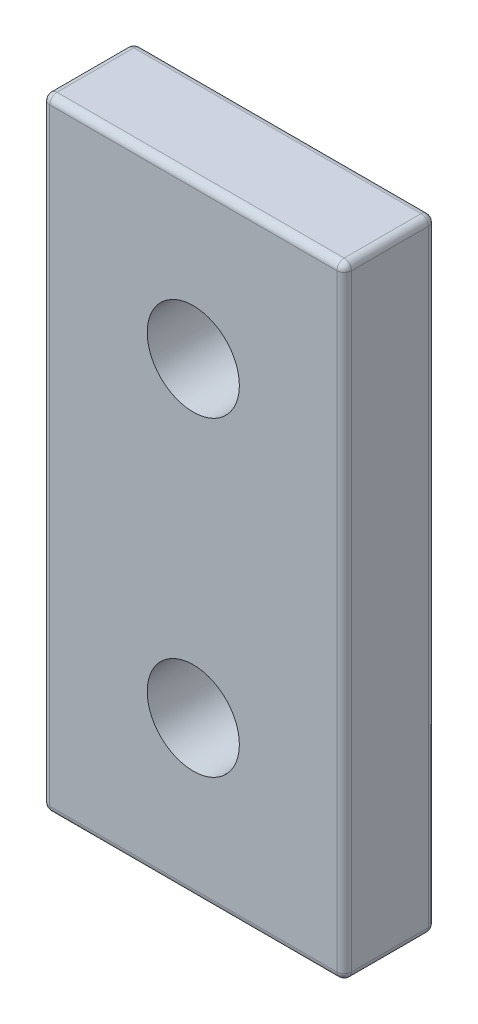
ISO-10303-21;
HEADER;
FILE_DESCRIPTION(('STEP AP214'),'2;1');
FILE_NAME('part.step','',(''),(''),'','','');
FILE_SCHEMA(('AUTOMOTIVE_DESIGN { 1 0 10303 214 1 1 1 1 }'));
ENDSEC;
DATA;
#1=APPLICATION_CONTEXT('core data for automotive mechanical design processes');
#2=APPLICATION_PROTOCOL_DEFINITION('international standard','automotive_design',2000,#1);
#3=PRODUCT_CONTEXT('',#1,'mechanical');
#4=PRODUCT('Part','Part','',(#3));
#5=PRODUCT_RELATED_PRODUCT_CATEGORY('part','',(#4));
#6=PRODUCT_DEFINITION_FORMATION('','',#4);
#7=PRODUCT_DEFINITION_CONTEXT('part definition',#1,'design');
#8=PRODUCT_DEFINITION('design','',#6,#7);
#9=PRODUCT_DEFINITION_SHAPE('','',#8);
#10=(LENGTH_UNIT() NAMED_UNIT(*) SI_UNIT(.MILLI.,.METRE.));
#11=(NAMED_UNIT(*) PLANE_ANGLE_UNIT() SI_UNIT($,.RADIAN.));
#12=(NAMED_UNIT(*) SI_UNIT($,.STERADIAN.) SOLID_ANGLE_UNIT());
#13=UNCERTAINTY_MEASURE_WITH_UNIT(LENGTH_MEASURE(1.E-05),#10,'distance_accuracy_value','');
#14=(GEOMETRIC_REPRESENTATION_CONTEXT(3) GLOBAL_UNCERTAINTY_ASSIGNED_CONTEXT((#13)) GLOBAL_UNIT_ASSIGNED_CONTEXT((#10,
#11,#12)) REPRESENTATION_CONTEXT('',''));
#15=CARTESIAN_POINT('',(0.,0.,0.));
#16=DIRECTION('',(0.,0.,1.));
#17=DIRECTION('',(1.,0.,0.));
#18=AXIS2_PLACEMENT_3D('',#15,#16,#17);
#19=CARTESIAN_POINT('',(758.507494380179,-1901.07831358663,5.));
#20=DIRECTION('',(0.,0.,-1.));
#21=DIRECTION('',(-1.,0.,0.));
#22=AXIS2_PLACEMENT_3D('',#19,#20,#21);
#23=CYLINDRICAL_SURFACE('',#22,2.5200000000001);
#24=CARTESIAN_POINT('',(758.507494380179,-1901.07831358663,5.));
#25=DIRECTION('',(0.,0.,1.));
#26=DIRECTION('',(1.,0.,0.));
#27=AXIS2_PLACEMENT_3D('',#24,#25,#26);
#28=CIRCLE('',#27,2.5200000000001);
#29=CARTESIAN_POINT('',(761.027494380179,-1901.07831358663,5.));
#30=VERTEX_POINT('',#29);
#31=EDGE_CURVE('E445',#30,#30,#28,.T.);
#32=ORIENTED_EDGE('',*,*,#31,.T.);
#33=EDGE_LOOP('',(#32));
#34=FACE_BOUND('',#33,.T.);
#35=CARTESIAN_POINT('',(758.507494380179,-1901.07831358663,0.));
#36=DIRECTION('',(0.,0.,1.));
#37=DIRECTION('',(1.,0.,0.));
#38=AXIS2_PLACEMENT_3D('',#35,#36,#37);
#39=CIRCLE('',#38,2.5200000000001);
#40=CARTESIAN_POINT('',(761.027494380179,-1901.07831358663,0.));
#41=VERTEX_POINT('',#40);
#42=EDGE_CURVE('E452',#41,#41,#39,.T.);
#43=ORIENTED_EDGE('',*,*,#42,.F.);
#44=EDGE_LOOP('',(#43));
#45=FACE_BOUND('',#44,.T.);
#46=ADVANCED_FACE('F133',(#34,#45),#23,.F.);
#47=CARTESIAN_POINT('',(0.,0.,0.));
#48=DIRECTION('',(0.,0.,1.));
#49=DIRECTION('',(1.,0.,0.));
#50=AXIS2_PLACEMENT_3D('',#47,#48,#49);
#51=PLANE('',#50);
#52=DIRECTION('',(0.,1.,0.));
#53=VECTOR('',#52,1.);
#54=CARTESIAN_POINT('',(766.357494380179,0.,0.));
#55=LINE('',#54,#53);
#56=CARTESIAN_POINT('',(766.357494380179,-1875.97831358663,0.));
#57=VERTEX_POINT('',#56);
#58=CARTESIAN_POINT('',(766.357494380179,-1909.17831358663,0.));
#59=VERTEX_POINT('',#58);
#60=EDGE_CURVE('E314',#57,#59,#55,.F.);
#61=ORIENTED_EDGE('',*,*,#60,.T.);
#62=DIRECTION('',(1.,0.,0.));
#63=VECTOR('',#62,1.);
#64=CARTESIAN_POINT('',(-2.56922875376836E-11,-1909.17831358662,0.));
#65=LINE('',#64,#63);
#66=CARTESIAN_POINT('',(750.657494380179,-1909.17831358663,0.));
#67=VERTEX_POINT('',#66);
#68=EDGE_CURVE('E143',#59,#67,#65,.F.);
#69=ORIENTED_EDGE('',*,*,#68,.T.);
#70=DIRECTION('',(0.,1.,0.));
#71=VECTOR('',#70,1.);
#72=CARTESIAN_POINT('',(750.657494380179,-1875.57831358663,0.));
#73=LINE('',#72,#71);
#74=CARTESIAN_POINT('',(750.657494380179,-1875.97831358663,0.));
#75=VERTEX_POINT('',#74);
#76=EDGE_CURVE('E261',#67,#75,#73,.T.);
#77=ORIENTED_EDGE('',*,*,#76,.T.);
#78=DIRECTION('',(1.,0.,0.));
#79=VECTOR('',#78,1.);
#80=CARTESIAN_POINT('',(766.357494380179,-1875.97831358663,0.));
#81=LINE('',#80,#79);
#82=EDGE_CURVE('E376',#75,#57,#81,.T.);
#83=ORIENTED_EDGE('',*,*,#82,.T.);
#84=EDGE_LOOP('',(#61,#69,#77,#83));
#85=FACE_BOUND('',#84,.T.);
#86=CARTESIAN_POINT('',(758.507494380179,-1884.07831358663,0.));
#87=DIRECTION('',(0.,0.,1.));
#88=DIRECTION('',(1.,0.,0.));
#89=AXIS2_PLACEMENT_3D('',#86,#87,#88);
#90=CIRCLE('',#89,2.5200000000001);
#91=CARTESIAN_POINT('',(761.027494380179,-1884.07831358663,0.));
#92=VERTEX_POINT('',#91);
#93=EDGE_CURVE('E349',#92,#92,#90,.F.);
#94=ORIENTED_EDGE('',*,*,#93,.F.);
#95=EDGE_LOOP('',(#94));
#96=FACE_BOUND('',#95,.T.);
#97=ORIENTED_EDGE('',*,*,#42,.T.);
#98=EDGE_LOOP('',(#97));
#99=FACE_BOUND('',#98,.T.);
#100=ADVANCED_FACE('F440',(#85,#96,#99),#51,.F.);
#101=CARTESIAN_POINT('',(758.507494380179,-1884.07831358663,5.));
#102=DIRECTION('',(0.,0.,-1.));
#103=DIRECTION('',(-1.,0.,0.));
#104=AXIS2_PLACEMENT_3D('',#101,#102,#103);
#105=CYLINDRICAL_SURFACE('',#104,2.5200000000001);
#106=CARTESIAN_POINT('',(758.507494380179,-1884.07831358663,5.));
#107=DIRECTION('',(0.,0.,1.));
#108=DIRECTION('',(1.,0.,0.));
#109=AXIS2_PLACEMENT_3D('',#106,#107,#108);
#110=CIRCLE('',#109,2.5200000000001);
#111=CARTESIAN_POINT('',(761.027494380179,-1884.07831358663,5.));
#112=VERTEX_POINT('',#111);
#113=EDGE_CURVE('E449',#112,#112,#110,.F.);
#114=ORIENTED_EDGE('',*,*,#113,.F.);
#115=EDGE_LOOP('',(#114));
#116=FACE_BOUND('',#115,.T.);
#117=ORIENTED_EDGE('',*,*,#93,.T.);
#118=EDGE_LOOP('',(#117));
#119=FACE_BOUND('',#118,.T.);
#120=ADVANCED_FACE('F489',(#116,#119),#105,.F.);
#121=CARTESIAN_POINT('',(-2.56976704371969E-11,-1909.57831358662,5.));
#122=DIRECTION('',(0.,1.,0.));
#123=DIRECTION('',(-1.,0.,0.));
#124=AXIS2_PLACEMENT_3D('',#121,#122,#123);
#125=PLANE('',#124);
#126=DIRECTION('',(0.,0.,-1.));
#127=VECTOR('',#126,1.);
#128=CARTESIAN_POINT('',(750.657494380179,-1909.57831358663,0.));
#129=LINE('',#128,#127);
#130=CARTESIAN_POINT('',(750.657494380179,-1909.57831358663,4.6));
#131=VERTEX_POINT('',#130);
#132=CARTESIAN_POINT('',(750.657494380179,-1909.57831358663,0.4));
#133=VERTEX_POINT('',#132);
#134=EDGE_CURVE('E272',#131,#133,#129,.T.);
#135=ORIENTED_EDGE('',*,*,#134,.T.);
#136=DIRECTION('',(1.,0.,0.));
#137=VECTOR('',#136,1.);
#138=CARTESIAN_POINT('',(-2.56976704371969E-11,-1909.57831358662,0.4));
#139=LINE('',#138,#137);
#140=CARTESIAN_POINT('',(766.357494380179,-1909.57831358663,0.4));
#141=VERTEX_POINT('',#140);
#142=EDGE_CURVE('E373',#133,#141,#139,.T.);
#143=ORIENTED_EDGE('',*,*,#142,.T.);
#144=DIRECTION('',(0.,0.,-1.));
#145=VECTOR('',#144,1.);
#146=CARTESIAN_POINT('',(766.357494380179,-1909.57831358663,5.));
#147=LINE('',#146,#145);
#148=CARTESIAN_POINT('',(766.357494380179,-1909.57831358663,4.6));
#149=VERTEX_POINT('',#148);
#150=EDGE_CURVE('E293',#141,#149,#147,.F.);
#151=ORIENTED_EDGE('',*,*,#150,.T.);
#152=DIRECTION('',(1.,0.,0.));
#153=VECTOR('',#152,1.);
#154=CARTESIAN_POINT('',(750.657494380179,-1909.57831358663,4.6));
#155=LINE('',#154,#153);
#156=EDGE_CURVE('E296',#149,#131,#155,.F.);
#157=ORIENTED_EDGE('',*,*,#156,.T.);
#158=EDGE_LOOP('',(#135,#143,#151,#157));
#159=FACE_BOUND('',#158,.T.);
#160=ADVANCED_FACE('F464',(#159),#125,.F.);
#161=CARTESIAN_POINT('',(750.257494380179,0.,5.));
#162=DIRECTION('',(-1.,0.,0.));
#163=DIRECTION('',(0.,0.,1.));
#164=AXIS2_PLACEMENT_3D('',#161,#162,#163);
#165=PLANE('',#164);
#166=DIRECTION('',(0.,1.,0.));
#167=VECTOR('',#166,1.);
#168=CARTESIAN_POINT('',(750.257494380179,-1909.57831358663,0.4));
#169=LINE('',#168,#167);
#170=CARTESIAN_POINT('',(750.257494380179,-1875.97831358663,0.4));
#171=VERTEX_POINT('',#170);
#172=CARTESIAN_POINT('',(750.257494380179,-1909.17831358663,0.4));
#173=VERTEX_POINT('',#172);
#174=EDGE_CURVE('E252',#171,#173,#169,.F.);
#175=ORIENTED_EDGE('',*,*,#174,.T.);
#176=DIRECTION('',(0.,0.,-1.));
#177=VECTOR('',#176,1.);
#178=CARTESIAN_POINT('',(750.257494380179,-1909.17831358663,5.));
#179=LINE('',#178,#177);
#180=CARTESIAN_POINT('',(750.257494380179,-1909.17831358663,4.6));
#181=VERTEX_POINT('',#180);
#182=EDGE_CURVE('E250',#173,#181,#179,.F.);
#183=ORIENTED_EDGE('',*,*,#182,.T.);
#184=DIRECTION('',(0.,1.,0.));
#185=VECTOR('',#184,1.);
#186=CARTESIAN_POINT('',(750.257494380179,0.,4.6));
#187=LINE('',#186,#185);
#188=CARTESIAN_POINT('',(750.257494380179,-1875.97831358663,4.6));
#189=VERTEX_POINT('',#188);
#190=EDGE_CURVE('E229',#181,#189,#187,.T.);
#191=ORIENTED_EDGE('',*,*,#190,.T.);
#192=DIRECTION('',(0.,0.,-1.));
#193=VECTOR('',#192,1.);
#194=CARTESIAN_POINT('',(750.257494380179,-1875.97831358663,5.));
#195=LINE('',#194,#193);
#196=EDGE_CURVE('E247',#189,#171,#195,.T.);
#197=ORIENTED_EDGE('',*,*,#196,.T.);
#198=EDGE_LOOP('',(#175,#183,#191,#197));
#199=FACE_BOUND('',#198,.T.);
#200=ADVANCED_FACE('F246',(#199),#165,.T.);
#201=CARTESIAN_POINT('',(5.04802479571278E-11,-1875.57831358665,5.));
#202=DIRECTION('',(0.,1.,0.));
#203=DIRECTION('',(-1.,0.,0.));
#204=AXIS2_PLACEMENT_3D('',#201,#202,#203);
#205=PLANE('',#204);
#206=DIRECTION('',(0.,0.,-1.));
#207=VECTOR('',#206,1.);
#208=CARTESIAN_POINT('',(766.357494380179,-1875.57831358663,0.));
#209=LINE('',#208,#207);
#210=CARTESIAN_POINT('',(766.357494380179,-1875.57831358663,4.6));
#211=VERTEX_POINT('',#210);
#212=CARTESIAN_POINT('',(766.357494380179,-1875.57831358663,0.4));
#213=VERTEX_POINT('',#212);
#214=EDGE_CURVE('E278',#211,#213,#209,.T.);
#215=ORIENTED_EDGE('',*,*,#214,.T.);
#216=DIRECTION('',(1.,0.,0.));
#217=VECTOR('',#216,1.);
#218=CARTESIAN_POINT('',(750.657494380179,-1875.57831358663,0.4));
#219=LINE('',#218,#217);
#220=CARTESIAN_POINT('',(750.657494380179,-1875.57831358663,0.4));
#221=VERTEX_POINT('',#220);
#222=EDGE_CURVE('E12',#213,#221,#219,.F.);
#223=ORIENTED_EDGE('',*,*,#222,.T.);
#224=DIRECTION('',(0.,0.,-1.));
#225=VECTOR('',#224,1.);
#226=CARTESIAN_POINT('',(750.657494380179,-1875.57831358663,5.));
#227=LINE('',#226,#225);
#228=CARTESIAN_POINT('',(750.657494380179,-1875.57831358663,4.6));
#229=VERTEX_POINT('',#228);
#230=EDGE_CURVE('E267',#221,#229,#227,.F.);
#231=ORIENTED_EDGE('',*,*,#230,.T.);
#232=DIRECTION('',(1.,0.,0.));
#233=VECTOR('',#232,1.);
#234=CARTESIAN_POINT('',(5.04802479571278E-11,-1875.57831358665,4.6));
#235=LINE('',#234,#233);
#236=EDGE_CURVE('E281',#229,#211,#235,.T.);
#237=ORIENTED_EDGE('',*,*,#236,.T.);
#238=EDGE_LOOP('',(#215,#223,#231,#237));
#239=FACE_BOUND('',#238,.T.);
#240=ADVANCED_FACE('F480',(#239),#205,.T.);
#241=CARTESIAN_POINT('',(766.757494380179,0.,5.));
#242=DIRECTION('',(-1.,0.,0.));
#243=DIRECTION('',(0.,0.,1.));
#244=AXIS2_PLACEMENT_3D('',#241,#242,#243);
#245=PLANE('',#244);
#246=DIRECTION('',(0.,0.,-1.));
#247=VECTOR('',#246,1.);
#248=CARTESIAN_POINT('',(766.757494380179,-1875.97831358663,5.));
#249=LINE('',#248,#247);
#250=CARTESIAN_POINT('',(766.757494380179,-1875.97831358663,0.4));
#251=VERTEX_POINT('',#250);
#252=CARTESIAN_POINT('',(766.757494380179,-1875.97831358663,4.6));
#253=VERTEX_POINT('',#252);
#254=EDGE_CURVE('E307',#251,#253,#249,.F.);
#255=ORIENTED_EDGE('',*,*,#254,.T.);
#256=DIRECTION('',(0.,1.,0.));
#257=VECTOR('',#256,1.);
#258=CARTESIAN_POINT('',(766.757494380179,-1909.57831358663,4.6));
#259=LINE('',#258,#257);
#260=CARTESIAN_POINT('',(766.757494380179,-1909.17831358663,4.6));
#261=VERTEX_POINT('',#260);
#262=EDGE_CURVE('E310',#253,#261,#259,.F.);
#263=ORIENTED_EDGE('',*,*,#262,.T.);
#264=DIRECTION('',(0.,0.,-1.));
#265=VECTOR('',#264,1.);
#266=CARTESIAN_POINT('',(766.757494380179,-1909.17831358663,5.));
#267=LINE('',#266,#265);
#268=CARTESIAN_POINT('',(766.757494380179,-1909.17831358663,0.4));
#269=VERTEX_POINT('',#268);
#270=EDGE_CURVE('E299',#261,#269,#267,.T.);
#271=ORIENTED_EDGE('',*,*,#270,.T.);
#272=DIRECTION('',(0.,1.,0.));
#273=VECTOR('',#272,1.);
#274=CARTESIAN_POINT('',(766.757494380179,0.,0.4));
#275=LINE('',#274,#273);
#276=EDGE_CURVE('E303',#269,#251,#275,.T.);
#277=ORIENTED_EDGE('',*,*,#276,.T.);
#278=EDGE_LOOP('',(#255,#263,#271,#277));
#279=FACE_BOUND('',#278,.T.);
#280=ADVANCED_FACE('F406',(#279),#245,.F.);
#281=CARTESIAN_POINT('',(0.,0.,5.));
#282=DIRECTION('',(0.,0.,1.));
#283=DIRECTION('',(1.,0.,0.));
#284=AXIS2_PLACEMENT_3D('',#281,#282,#283);
#285=PLANE('',#284);
#286=DIRECTION('',(0.,1.,0.));
#287=VECTOR('',#286,1.);
#288=CARTESIAN_POINT('',(766.357494380179,-1875.57831358663,5.));
#289=LINE('',#288,#287);
#290=CARTESIAN_POINT('',(766.357494380179,-1909.17831358663,5.));
#291=VERTEX_POINT('',#290);
#292=CARTESIAN_POINT('',(766.357494380179,-1875.97831358663,5.));
#293=VERTEX_POINT('',#292);
#294=EDGE_CURVE('E284',#291,#293,#289,.T.);
#295=ORIENTED_EDGE('',*,*,#294,.T.);
#296=DIRECTION('',(1.,0.,0.));
#297=VECTOR('',#296,1.);
#298=CARTESIAN_POINT('',(5.04910137561545E-11,-1875.97831358665,5.));
#299=LINE('',#298,#297);
#300=CARTESIAN_POINT('',(750.657494380179,-1875.97831358663,5.));
#301=VERTEX_POINT('',#300);
#302=EDGE_CURVE('E290',#293,#301,#299,.F.);
#303=ORIENTED_EDGE('',*,*,#302,.T.);
#304=DIRECTION('',(0.,1.,0.));
#305=VECTOR('',#304,1.);
#306=CARTESIAN_POINT('',(750.657494380179,0.,5.));
#307=LINE('',#306,#305);
#308=CARTESIAN_POINT('',(750.657494380179,-1909.17831358663,5.));
#309=VERTEX_POINT('',#308);
#310=EDGE_CURVE('E232',#301,#309,#307,.F.);
#311=ORIENTED_EDGE('',*,*,#310,.T.);
#312=DIRECTION('',(1.,0.,0.));
#313=VECTOR('',#312,1.);
#314=CARTESIAN_POINT('',(766.757494380179,-1909.17831358663,5.));
#315=LINE('',#314,#313);
#316=EDGE_CURVE('E287',#309,#291,#315,.T.);
#317=ORIENTED_EDGE('',*,*,#316,.T.);
#318=EDGE_LOOP('',(#295,#303,#311,#317));
#319=FACE_BOUND('',#318,.T.);
#320=ORIENTED_EDGE('',*,*,#113,.T.);
#321=EDGE_LOOP('',(#320));
#322=FACE_BOUND('',#321,.T.);
#323=ORIENTED_EDGE('',*,*,#31,.F.);
#324=EDGE_LOOP('',(#323));
#325=FACE_BOUND('',#324,.T.);
#326=ADVANCED_FACE('F476',(#319,#322,#325),#285,.T.);
#327=CARTESIAN_POINT('',(750.657494380179,0.,4.6));
#328=DIRECTION('',(0.,1.,0.));
#329=DIRECTION('',(0.,0.,1.));
#330=AXIS2_PLACEMENT_3D('',#327,#328,#329);
#331=CYLINDRICAL_SURFACE('',#330,0.4);
#332=ORIENTED_EDGE('',*,*,#310,.F.);
#333=CARTESIAN_POINT('',(750.657494380179,-1875.97831358663,4.6));
#334=DIRECTION('',(0.,1.,0.));
#335=DIRECTION('',(0.,0.,1.));
#336=AXIS2_PLACEMENT_3D('',#333,#334,#335);
#337=CIRCLE('',#336,0.4);
#338=EDGE_CURVE('E226',#301,#189,#337,.F.);
#339=ORIENTED_EDGE('',*,*,#338,.T.);
#340=ORIENTED_EDGE('',*,*,#190,.F.);
#341=CARTESIAN_POINT('',(750.657494380179,-1909.17831358663,4.6));
#342=DIRECTION('',(0.,1.,0.));
#343=DIRECTION('',(0.,0.,1.));
#344=AXIS2_PLACEMENT_3D('',#341,#342,#343);
#345=CIRCLE('',#344,0.4);
#346=EDGE_CURVE('E239',#181,#309,#345,.T.);
#347=ORIENTED_EDGE('',*,*,#346,.T.);
#348=EDGE_LOOP('',(#332,#339,#340,#347));
#349=FACE_BOUND('',#348,.T.);
#350=ADVANCED_FACE('F228',(#349),#331,.T.);
#351=CARTESIAN_POINT('',(750.657494380179,-1909.17831358663,5.));
#352=DIRECTION('',(0.,0.,1.));
#353=DIRECTION('',(1.,0.,0.));
#354=AXIS2_PLACEMENT_3D('',#351,#352,#353);
#355=CYLINDRICAL_SURFACE('',#354,0.4);
#356=ORIENTED_EDGE('',*,*,#182,.F.);
#357=CARTESIAN_POINT('',(750.657494380179,-1909.17831358663,0.4));
#358=DIRECTION('',(0.,0.,1.));
#359=DIRECTION('',(1.,0.,0.));
#360=AXIS2_PLACEMENT_3D('',#357,#358,#359);
#361=CIRCLE('',#360,0.4);
#362=EDGE_CURVE('E357',#173,#133,#361,.T.);
#363=ORIENTED_EDGE('',*,*,#362,.T.);
#364=ORIENTED_EDGE('',*,*,#134,.F.);
#365=CARTESIAN_POINT('',(750.657494380179,-1909.17831358663,4.6));
#366=DIRECTION('',(0.,0.,1.));
#367=DIRECTION('',(1.,0.,0.));
#368=AXIS2_PLACEMENT_3D('',#365,#366,#367);
#369=CIRCLE('',#368,0.4);
#370=EDGE_CURVE('E238',#131,#181,#369,.F.);
#371=ORIENTED_EDGE('',*,*,#370,.T.);
#372=EDGE_LOOP('',(#356,#363,#364,#371));
#373=FACE_BOUND('',#372,.T.);
#374=ADVANCED_FACE('F468',(#373),#355,.T.);
#375=CARTESIAN_POINT('',(750.657494380179,-1875.97831358663,5.));
#376=DIRECTION('',(0.,0.,-1.));
#377=DIRECTION('',(-1.,0.,0.));
#378=AXIS2_PLACEMENT_3D('',#375,#376,#377);
#379=CYLINDRICAL_SURFACE('',#378,0.4);
#380=ORIENTED_EDGE('',*,*,#230,.F.);
#381=CARTESIAN_POINT('',(750.657494380179,-1875.97831358663,0.4));
#382=DIRECTION('',(0.,0.,-1.));
#383=DIRECTION('',(-1.,0.,0.));
#384=AXIS2_PLACEMENT_3D('',#381,#382,#383);
#385=CIRCLE('',#384,0.4);
#386=EDGE_CURVE('E259',#221,#171,#385,.F.);
#387=ORIENTED_EDGE('',*,*,#386,.T.);
#388=ORIENTED_EDGE('',*,*,#196,.F.);
#389=CARTESIAN_POINT('',(750.657494380179,-1875.97831358663,4.6));
#390=DIRECTION('',(0.,0.,-1.));
#391=DIRECTION('',(-1.,0.,0.));
#392=AXIS2_PLACEMENT_3D('',#389,#390,#391);
#393=CIRCLE('',#392,0.4);
#394=EDGE_CURVE('E257',#189,#229,#393,.T.);
#395=ORIENTED_EDGE('',*,*,#394,.T.);
#396=EDGE_LOOP('',(#380,#387,#388,#395));
#397=FACE_BOUND('',#396,.T.);
#398=ADVANCED_FACE('F256',(#397),#379,.T.);
#399=CARTESIAN_POINT('',(750.657494380179,0.,0.4));
#400=DIRECTION('',(0.,-1.,0.));
#401=DIRECTION('',(0.,0.,-1.));
#402=AXIS2_PLACEMENT_3D('',#399,#400,#401);
#403=CYLINDRICAL_SURFACE('',#402,0.4);
#404=ORIENTED_EDGE('',*,*,#76,.F.);
#405=CARTESIAN_POINT('',(750.657494380179,-1909.17831358663,0.4));
#406=DIRECTION('',(0.,-1.,0.));
#407=DIRECTION('',(0.,0.,-1.));
#408=AXIS2_PLACEMENT_3D('',#405,#406,#407);
#409=CIRCLE('',#408,0.4);
#410=EDGE_CURVE('E353',#67,#173,#409,.F.);
#411=ORIENTED_EDGE('',*,*,#410,.T.);
#412=ORIENTED_EDGE('',*,*,#174,.F.);
#413=CARTESIAN_POINT('',(750.657494380179,-1875.97831358663,0.4));
#414=DIRECTION('',(0.,-1.,0.));
#415=DIRECTION('',(0.,0.,-1.));
#416=AXIS2_PLACEMENT_3D('',#413,#414,#415);
#417=CIRCLE('',#416,0.4);
#418=EDGE_CURVE('E318',#171,#75,#417,.T.);
#419=ORIENTED_EDGE('',*,*,#418,.T.);
#420=EDGE_LOOP('',(#404,#411,#412,#419));
#421=FACE_BOUND('',#420,.T.);
#422=ADVANCED_FACE('F443',(#421),#403,.T.);
#423=CARTESIAN_POINT('',(750.657494380179,-1909.17831358663,4.6));
#424=DIRECTION('',(0.,0.,1.));
#425=DIRECTION('',(1.,0.,0.));
#426=AXIS2_PLACEMENT_3D('',#423,#424,#425);
#427=SPHERICAL_SURFACE('',#426,0.4);
#428=ORIENTED_EDGE('',*,*,#346,.F.);
#429=ORIENTED_EDGE('',*,*,#370,.F.);
#430=CARTESIAN_POINT('',(750.657494380179,-1909.17831358663,4.6));
#431=DIRECTION('',(1.,0.,0.));
#432=DIRECTION('',(0.,0.,-1.));
#433=AXIS2_PLACEMENT_3D('',#430,#431,#432);
#434=CIRCLE('',#433,0.4);
#435=EDGE_CURVE('E345',#309,#131,#434,.T.);
#436=ORIENTED_EDGE('',*,*,#435,.F.);
#437=EDGE_LOOP('',(#428,#429,#436));
#438=FACE_BOUND('',#437,.T.);
#439=ADVANCED_FACE('F471',(#438),#427,.T.);
#440=CARTESIAN_POINT('',(766.357494380179,-1909.17831358663,5.));
#441=DIRECTION('',(0.,0.,-1.));
#442=DIRECTION('',(-1.,0.,0.));
#443=AXIS2_PLACEMENT_3D('',#440,#441,#442);
#444=CYLINDRICAL_SURFACE('',#443,0.4);
#445=ORIENTED_EDGE('',*,*,#150,.F.);
#446=CARTESIAN_POINT('',(766.357494380179,-1909.17831358663,0.4));
#447=DIRECTION('',(0.,0.,-1.));
#448=DIRECTION('',(-1.,0.,0.));
#449=AXIS2_PLACEMENT_3D('',#446,#447,#448);
#450=CIRCLE('',#449,0.4);
#451=EDGE_CURVE('E366',#141,#269,#450,.F.);
#452=ORIENTED_EDGE('',*,*,#451,.T.);
#453=ORIENTED_EDGE('',*,*,#270,.F.);
#454=CARTESIAN_POINT('',(766.357494380179,-1909.17831358663,4.6));
#455=DIRECTION('',(0.,0.,1.));
#456=DIRECTION('',(1.,0.,0.));
#457=AXIS2_PLACEMENT_3D('',#454,#455,#456);
#458=CIRCLE('',#457,0.4);
#459=EDGE_CURVE('E341',#149,#261,#458,.T.);
#460=ORIENTED_EDGE('',*,*,#459,.F.);
#461=EDGE_LOOP('',(#445,#452,#453,#460));
#462=FACE_BOUND('',#461,.T.);
#463=ADVANCED_FACE('F426',(#462),#444,.T.);
#464=CARTESIAN_POINT('',(-2.56922875376836E-11,-1909.17831358662,4.6));
#465=DIRECTION('',(-1.,0.,0.));
#466=DIRECTION('',(0.,-1.,0.));
#467=AXIS2_PLACEMENT_3D('',#464,#465,#466);
#468=CYLINDRICAL_SURFACE('',#467,0.4);
#469=ORIENTED_EDGE('',*,*,#435,.T.);
#470=ORIENTED_EDGE('',*,*,#156,.F.);
#471=CARTESIAN_POINT('',(766.357494380179,-1909.17831358663,4.6));
#472=DIRECTION('',(1.,0.,0.));
#473=DIRECTION('',(0.,0.,-1.));
#474=AXIS2_PLACEMENT_3D('',#471,#472,#473);
#475=CIRCLE('',#474,0.4);
#476=EDGE_CURVE('E337',#291,#149,#475,.T.);
#477=ORIENTED_EDGE('',*,*,#476,.F.);
#478=ORIENTED_EDGE('',*,*,#316,.F.);
#479=EDGE_LOOP('',(#469,#470,#477,#478));
#480=FACE_BOUND('',#479,.T.);
#481=ADVANCED_FACE('F474',(#480),#468,.T.);
#482=CARTESIAN_POINT('',(766.357494380179,0.,0.4));
#483=DIRECTION('',(0.,1.,0.));
#484=DIRECTION('',(0.,0.,1.));
#485=AXIS2_PLACEMENT_3D('',#482,#483,#484);
#486=CYLINDRICAL_SURFACE('',#485,0.4);
#487=ORIENTED_EDGE('',*,*,#276,.F.);
#488=CARTESIAN_POINT('',(766.357494380179,-1909.17831358663,0.4));
#489=DIRECTION('',(0.,1.,0.));
#490=DIRECTION('',(0.,0.,1.));
#491=AXIS2_PLACEMENT_3D('',#488,#489,#490);
#492=CIRCLE('',#491,0.4);
#493=EDGE_CURVE('E363',#269,#59,#492,.T.);
#494=ORIENTED_EDGE('',*,*,#493,.T.);
#495=ORIENTED_EDGE('',*,*,#60,.F.);
#496=CARTESIAN_POINT('',(766.357494380179,-1875.97831358663,0.4));
#497=DIRECTION('',(0.,1.,0.));
#498=DIRECTION('',(0.,0.,1.));
#499=AXIS2_PLACEMENT_3D('',#496,#497,#498);
#500=CIRCLE('',#499,0.4);
#501=EDGE_CURVE('E360',#57,#251,#500,.F.);
#502=ORIENTED_EDGE('',*,*,#501,.T.);
#503=EDGE_LOOP('',(#487,#494,#495,#502));
#504=FACE_BOUND('',#503,.T.);
#505=ADVANCED_FACE('F403',(#504),#486,.T.);
#506=CARTESIAN_POINT('',(766.357494380179,-1909.17831358663,4.6));
#507=DIRECTION('',(0.,-1.,0.));
#508=DIRECTION('',(0.,0.,-1.));
#509=AXIS2_PLACEMENT_3D('',#506,#507,#508);
#510=SPHERICAL_SURFACE('',#509,0.4);
#511=ORIENTED_EDGE('',*,*,#476,.T.);
#512=ORIENTED_EDGE('',*,*,#459,.T.);
#513=CARTESIAN_POINT('',(766.357494380179,-1909.17831358663,4.6));
#514=DIRECTION('',(0.,-1.,0.));
#515=DIRECTION('',(0.,0.,-1.));
#516=AXIS2_PLACEMENT_3D('',#513,#514,#515);
#517=CIRCLE('',#516,0.4);
#518=EDGE_CURVE('E334',#291,#261,#517,.F.);
#519=ORIENTED_EDGE('',*,*,#518,.F.);
#520=EDGE_LOOP('',(#511,#512,#519));
#521=FACE_BOUND('',#520,.T.);
#522=ADVANCED_FACE('F422',(#521),#510,.T.);
#523=CARTESIAN_POINT('',(766.357494380179,-1875.97831358663,5.));
#524=DIRECTION('',(0.,0.,1.));
#525=DIRECTION('',(1.,0.,0.));
#526=AXIS2_PLACEMENT_3D('',#523,#524,#525);
#527=CYLINDRICAL_SURFACE('',#526,0.4);
#528=ORIENTED_EDGE('',*,*,#254,.F.);
#529=CARTESIAN_POINT('',(766.357494380179,-1875.97831358663,0.4));
#530=DIRECTION('',(0.,0.,1.));
#531=DIRECTION('',(1.,0.,0.));
#532=AXIS2_PLACEMENT_3D('',#529,#530,#531);
#533=CIRCLE('',#532,0.4);
#534=EDGE_CURVE('E151',#251,#213,#533,.T.);
#535=ORIENTED_EDGE('',*,*,#534,.T.);
#536=ORIENTED_EDGE('',*,*,#214,.F.);
#537=CARTESIAN_POINT('',(766.357494380179,-1875.97831358663,4.6));
#538=DIRECTION('',(0.,0.,1.));
#539=DIRECTION('',(1.,0.,0.));
#540=AXIS2_PLACEMENT_3D('',#537,#538,#539);
#541=CIRCLE('',#540,0.4);
#542=EDGE_CURVE('E330',#253,#211,#541,.T.);
#543=ORIENTED_EDGE('',*,*,#542,.F.);
#544=EDGE_LOOP('',(#528,#535,#536,#543));
#545=FACE_BOUND('',#544,.T.);
#546=ADVANCED_FACE('F410',(#545),#527,.T.);
#547=CARTESIAN_POINT('',(766.357494380179,0.,4.6));
#548=DIRECTION('',(0.,-1.,0.));
#549=DIRECTION('',(0.,0.,-1.));
#550=AXIS2_PLACEMENT_3D('',#547,#548,#549);
#551=CYLINDRICAL_SURFACE('',#550,0.4);
#552=ORIENTED_EDGE('',*,*,#518,.T.);
#553=ORIENTED_EDGE('',*,*,#262,.F.);
#554=CARTESIAN_POINT('',(766.357494380179,-1875.97831358663,4.6));
#555=DIRECTION('',(0.,1.,0.));
#556=DIRECTION('',(0.,0.,1.));
#557=AXIS2_PLACEMENT_3D('',#554,#555,#556);
#558=CIRCLE('',#557,0.4);
#559=EDGE_CURVE('E326',#293,#253,#558,.T.);
#560=ORIENTED_EDGE('',*,*,#559,.F.);
#561=ORIENTED_EDGE('',*,*,#294,.F.);
#562=EDGE_LOOP('',(#552,#553,#560,#561));
#563=FACE_BOUND('',#562,.T.);
#564=ADVANCED_FACE('F418',(#563),#551,.T.);
#565=CARTESIAN_POINT('',(766.357494380179,-1875.97831358663,4.6));
#566=DIRECTION('',(1.,0.,0.));
#567=DIRECTION('',(0.,0.,-1.));
#568=AXIS2_PLACEMENT_3D('',#565,#566,#567);
#569=SPHERICAL_SURFACE('',#568,0.4);
#570=ORIENTED_EDGE('',*,*,#559,.T.);
#571=ORIENTED_EDGE('',*,*,#542,.T.);
#572=CARTESIAN_POINT('',(766.357494380179,-1875.97831358663,4.6));
#573=DIRECTION('',(1.,0.,0.));
#574=DIRECTION('',(0.,0.,-1.));
#575=AXIS2_PLACEMENT_3D('',#572,#573,#574);
#576=CIRCLE('',#575,0.4);
#577=EDGE_CURVE('E321',#293,#211,#576,.F.);
#578=ORIENTED_EDGE('',*,*,#577,.F.);
#579=EDGE_LOOP('',(#570,#571,#578));
#580=FACE_BOUND('',#579,.T.);
#581=ADVANCED_FACE('F414',(#580),#569,.T.);
#582=CARTESIAN_POINT('',(5.04910137561545E-11,-1875.97831358665,4.6));
#583=DIRECTION('',(1.,0.,0.));
#584=DIRECTION('',(0.,1.,0.));
#585=AXIS2_PLACEMENT_3D('',#582,#583,#584);
#586=CYLINDRICAL_SURFACE('',#585,0.4);
#587=ORIENTED_EDGE('',*,*,#577,.T.);
#588=ORIENTED_EDGE('',*,*,#236,.F.);
#589=CARTESIAN_POINT('',(750.657494380179,-1875.97831358663,4.6));
#590=DIRECTION('',(-1.,0.,0.));
#591=DIRECTION('',(0.,0.,1.));
#592=AXIS2_PLACEMENT_3D('',#589,#590,#591);
#593=CIRCLE('',#592,0.4);
#594=EDGE_CURVE('E264',#301,#229,#593,.T.);
#595=ORIENTED_EDGE('',*,*,#594,.F.);
#596=ORIENTED_EDGE('',*,*,#302,.F.);
#597=EDGE_LOOP('',(#587,#588,#595,#596));
#598=FACE_BOUND('',#597,.T.);
#599=ADVANCED_FACE('F479',(#598),#586,.T.);
#600=CARTESIAN_POINT('',(750.657494380179,-1875.97831358663,4.6));
#601=DIRECTION('',(0.,0.,1.));
#602=DIRECTION('',(1.,0.,0.));
#603=AXIS2_PLACEMENT_3D('',#600,#601,#602);
#604=SPHERICAL_SURFACE('',#603,0.4);
#605=ORIENTED_EDGE('',*,*,#394,.F.);
#606=ORIENTED_EDGE('',*,*,#338,.F.);
#607=ORIENTED_EDGE('',*,*,#594,.T.);
#608=EDGE_LOOP('',(#605,#606,#607));
#609=FACE_BOUND('',#608,.T.);
#610=ADVANCED_FACE('F263',(#609),#604,.T.);
#611=CARTESIAN_POINT('',(766.357494380179,-1909.17831358663,0.4));
#612=DIRECTION('',(0.,0.,1.));
#613=DIRECTION('',(1.,0.,0.));
#614=AXIS2_PLACEMENT_3D('',#611,#612,#613);
#615=SPHERICAL_SURFACE('',#614,0.4);
#616=ORIENTED_EDGE('',*,*,#493,.F.);
#617=ORIENTED_EDGE('',*,*,#451,.F.);
#618=CARTESIAN_POINT('',(766.357494380179,-1909.17831358663,0.4));
#619=DIRECTION('',(-1.,0.,0.));
#620=DIRECTION('',(0.,0.,1.));
#621=AXIS2_PLACEMENT_3D('',#618,#619,#620);
#622=CIRCLE('',#621,0.4);
#623=EDGE_CURVE('E322',#59,#141,#622,.T.);
#624=ORIENTED_EDGE('',*,*,#623,.F.);
#625=EDGE_LOOP('',(#616,#617,#624));
#626=FACE_BOUND('',#625,.T.);
#627=ADVANCED_FACE('F430',(#626),#615,.T.);
#628=CARTESIAN_POINT('',(-2.56922875376836E-11,-1909.17831358662,0.4));
#629=DIRECTION('',(1.,0.,0.));
#630=DIRECTION('',(0.,1.,0.));
#631=AXIS2_PLACEMENT_3D('',#628,#629,#630);
#632=CYLINDRICAL_SURFACE('',#631,0.4);
#633=ORIENTED_EDGE('',*,*,#623,.T.);
#634=ORIENTED_EDGE('',*,*,#142,.F.);
#635=CARTESIAN_POINT('',(750.657494380179,-1909.17831358663,0.4));
#636=DIRECTION('',(-1.,0.,0.));
#637=DIRECTION('',(0.,0.,1.));
#638=AXIS2_PLACEMENT_3D('',#635,#636,#637);
#639=CIRCLE('',#638,0.4);
#640=EDGE_CURVE('E381',#67,#133,#639,.T.);
#641=ORIENTED_EDGE('',*,*,#640,.F.);
#642=ORIENTED_EDGE('',*,*,#68,.F.);
#643=EDGE_LOOP('',(#633,#634,#641,#642));
#644=FACE_BOUND('',#643,.T.);
#645=ADVANCED_FACE('F434',(#644),#632,.T.);
#646=CARTESIAN_POINT('',(750.657494380179,-1909.17831358663,0.4));
#647=DIRECTION('',(0.,0.,1.));
#648=DIRECTION('',(1.,0.,0.));
#649=AXIS2_PLACEMENT_3D('',#646,#647,#648);
#650=SPHERICAL_SURFACE('',#649,0.4);
#651=ORIENTED_EDGE('',*,*,#640,.T.);
#652=ORIENTED_EDGE('',*,*,#362,.F.);
#653=ORIENTED_EDGE('',*,*,#410,.F.);
#654=EDGE_LOOP('',(#651,#652,#653));
#655=FACE_BOUND('',#654,.T.);
#656=ADVANCED_FACE('F537',(#655),#650,.T.);
#657=CARTESIAN_POINT('',(766.357494380179,-1875.97831358663,0.4));
#658=DIRECTION('',(0.,0.,1.));
#659=DIRECTION('',(1.,0.,0.));
#660=AXIS2_PLACEMENT_3D('',#657,#658,#659);
#661=SPHERICAL_SURFACE('',#660,0.4);
#662=ORIENTED_EDGE('',*,*,#534,.F.);
#663=ORIENTED_EDGE('',*,*,#501,.F.);
#664=CARTESIAN_POINT('',(766.357494380179,-1875.97831358663,0.4));
#665=DIRECTION('',(-1.,0.,0.));
#666=DIRECTION('',(0.,0.,1.));
#667=AXIS2_PLACEMENT_3D('',#664,#665,#666);
#668=CIRCLE('',#667,0.4);
#669=EDGE_CURVE('E137',#213,#57,#668,.T.);
#670=ORIENTED_EDGE('',*,*,#669,.F.);
#671=EDGE_LOOP('',(#662,#663,#670));
#672=FACE_BOUND('',#671,.T.);
#673=ADVANCED_FACE('F135',(#672),#661,.T.);
#674=CARTESIAN_POINT('',(5.04910137561545E-11,-1875.97831358665,0.4));
#675=DIRECTION('',(-1.,0.,0.));
#676=DIRECTION('',(0.,-1.,0.));
#677=AXIS2_PLACEMENT_3D('',#674,#675,#676);
#678=CYLINDRICAL_SURFACE('',#677,0.4);
#679=ORIENTED_EDGE('',*,*,#669,.T.);
#680=ORIENTED_EDGE('',*,*,#82,.F.);
#681=CARTESIAN_POINT('',(750.657494380179,-1875.97831358663,0.4));
#682=DIRECTION('',(-1.,0.,0.));
#683=DIRECTION('',(0.,0.,1.));
#684=AXIS2_PLACEMENT_3D('',#681,#682,#683);
#685=CIRCLE('',#684,0.4);
#686=EDGE_CURVE('E387',#221,#75,#685,.T.);
#687=ORIENTED_EDGE('',*,*,#686,.F.);
#688=ORIENTED_EDGE('',*,*,#222,.F.);
#689=EDGE_LOOP('',(#679,#680,#687,#688));
#690=FACE_BOUND('',#689,.T.);
#691=ADVANCED_FACE('F397',(#690),#678,.T.);
#692=CARTESIAN_POINT('',(750.657494380179,-1875.97831358663,0.4));
#693=DIRECTION('',(0.,0.,1.));
#694=DIRECTION('',(1.,0.,0.));
#695=AXIS2_PLACEMENT_3D('',#692,#693,#694);
#696=SPHERICAL_SURFACE('',#695,0.4);
#697=ORIENTED_EDGE('',*,*,#418,.F.);
#698=ORIENTED_EDGE('',*,*,#386,.F.);
#699=ORIENTED_EDGE('',*,*,#686,.T.);
#700=EDGE_LOOP('',(#697,#698,#699));
#701=FACE_BOUND('',#700,.T.);
#702=ADVANCED_FACE('F481',(#701),#696,.T.);
#703=CLOSED_SHELL('',(#46,#100,#120,#160,#200,#240,#280,#326,#350,#374,#398,#422,#439,#463,#481,
#505,#522,#546,#564,#581,#599,#610,#627,#645,#656,#673,#691,#702));
#704=MANIFOLD_SOLID_BREP('B2',#703);
#705=ADVANCED_BREP_SHAPE_REPRESENTATION('',(#18,#704),#14);
#706=SHAPE_DEFINITION_REPRESENTATION(#9,#705);
ENDSEC;
END-ISO-10303-21;
